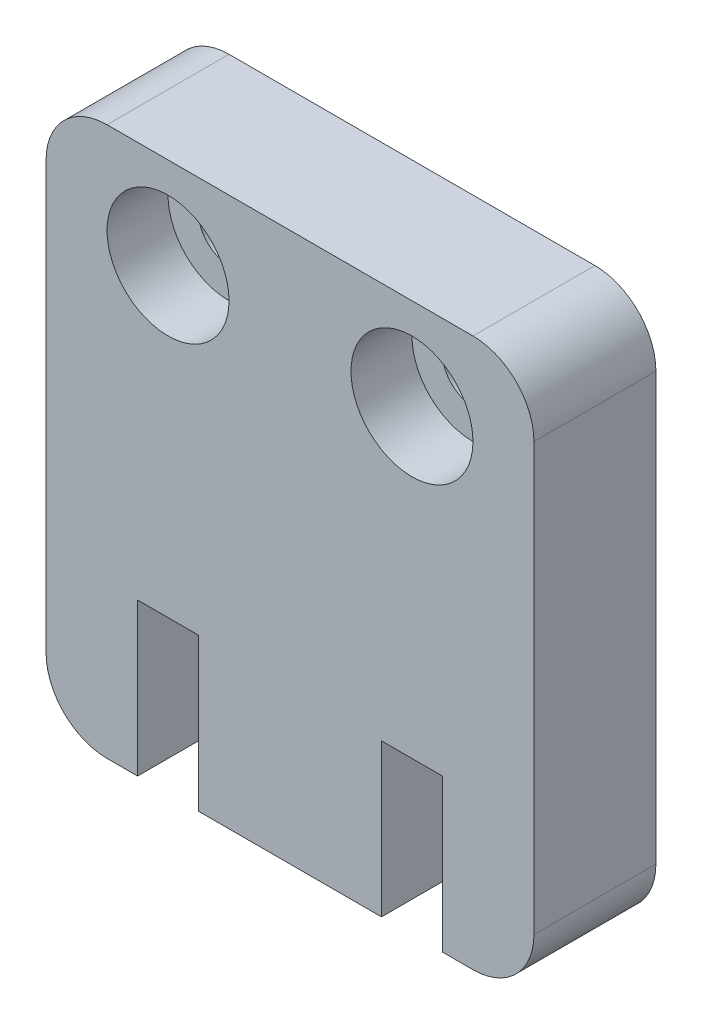
ISO-10303-21;
HEADER;
FILE_DESCRIPTION(('STEP AP214'),'2;1');
FILE_NAME('part.step','',(''),(''),'','','');
FILE_SCHEMA(('AUTOMOTIVE_DESIGN { 1 0 10303 214 1 1 1 1 }'));
ENDSEC;
DATA;
#1=APPLICATION_CONTEXT('core data for automotive mechanical design processes');
#2=APPLICATION_PROTOCOL_DEFINITION('international standard','automotive_design',2000,#1);
#3=PRODUCT_CONTEXT('',#1,'mechanical');
#4=PRODUCT('Part','Part','',(#3));
#5=PRODUCT_RELATED_PRODUCT_CATEGORY('part','',(#4));
#6=PRODUCT_DEFINITION_FORMATION('','',#4);
#7=PRODUCT_DEFINITION_CONTEXT('part definition',#1,'design');
#8=PRODUCT_DEFINITION('design','',#6,#7);
#9=PRODUCT_DEFINITION_SHAPE('','',#8);
#10=(LENGTH_UNIT() NAMED_UNIT(*) SI_UNIT(.MILLI.,.METRE.));
#11=(NAMED_UNIT(*) PLANE_ANGLE_UNIT() SI_UNIT($,.RADIAN.));
#12=(NAMED_UNIT(*) SI_UNIT($,.STERADIAN.) SOLID_ANGLE_UNIT());
#13=UNCERTAINTY_MEASURE_WITH_UNIT(LENGTH_MEASURE(1.E-05),#10,'distance_accuracy_value','');
#14=(GEOMETRIC_REPRESENTATION_CONTEXT(3) GLOBAL_UNCERTAINTY_ASSIGNED_CONTEXT((#13)) GLOBAL_UNIT_ASSIGNED_CONTEXT((#10,
#11,#12)) REPRESENTATION_CONTEXT('',''));
#15=CARTESIAN_POINT('',(0.,0.,0.));
#16=DIRECTION('',(0.,0.,1.));
#17=DIRECTION('',(1.,0.,0.));
#18=AXIS2_PLACEMENT_3D('',#15,#16,#17);
#19=CARTESIAN_POINT('',(12.,15.,4.));
#20=DIRECTION('',(0.,0.,-1.));
#21=DIRECTION('',(-1.,0.,0.));
#22=AXIS2_PLACEMENT_3D('',#19,#20,#21);
#23=CYLINDRICAL_SURFACE('',#22,1.);
#24=CARTESIAN_POINT('',(12.,15.,0.));
#25=DIRECTION('',(0.,0.,1.));
#26=DIRECTION('',(1.,0.,0.));
#27=AXIS2_PLACEMENT_3D('',#24,#25,#26);
#28=CIRCLE('',#27,1.);
#29=CARTESIAN_POINT('',(13.,15.,0.));
#30=VERTEX_POINT('',#29);
#31=EDGE_CURVE('E248',#30,#30,#28,.T.);
#32=ORIENTED_EDGE('',*,*,#31,.F.);
#33=EDGE_LOOP('',(#32));
#34=FACE_BOUND('',#33,.T.);
#35=CARTESIAN_POINT('',(12.,15.,2.));
#36=DIRECTION('',(0.,0.,1.));
#37=DIRECTION('',(1.,0.,0.));
#38=AXIS2_PLACEMENT_3D('',#35,#36,#37);
#39=CIRCLE('',#38,1.);
#40=CARTESIAN_POINT('',(13.,15.,2.));
#41=VERTEX_POINT('',#40);
#42=EDGE_CURVE('E37',#41,#41,#39,.T.);
#43=ORIENTED_EDGE('',*,*,#42,.T.);
#44=EDGE_LOOP('',(#43));
#45=FACE_BOUND('',#44,.T.);
#46=ADVANCED_FACE('F33',(#34,#45),#23,.F.);
#47=CARTESIAN_POINT('',(4.,15.,4.));
#48=DIRECTION('',(0.,0.,-1.));
#49=DIRECTION('',(-1.,0.,0.));
#50=AXIS2_PLACEMENT_3D('',#47,#48,#49);
#51=CYLINDRICAL_SURFACE('',#50,1.);
#52=CARTESIAN_POINT('',(4.,15.,0.));
#53=DIRECTION('',(0.,0.,1.));
#54=DIRECTION('',(1.,0.,0.));
#55=AXIS2_PLACEMENT_3D('',#52,#53,#54);
#56=CIRCLE('',#55,1.);
#57=CARTESIAN_POINT('',(5.,15.,0.));
#58=VERTEX_POINT('',#57);
#59=EDGE_CURVE('E184',#58,#58,#56,.T.);
#60=ORIENTED_EDGE('',*,*,#59,.F.);
#61=EDGE_LOOP('',(#60));
#62=FACE_BOUND('',#61,.T.);
#63=CARTESIAN_POINT('',(4.,15.,2.));
#64=DIRECTION('',(0.,0.,1.));
#65=DIRECTION('',(1.,0.,0.));
#66=AXIS2_PLACEMENT_3D('',#63,#64,#65);
#67=CIRCLE('',#66,1.);
#68=CARTESIAN_POINT('',(5.,15.,2.));
#69=VERTEX_POINT('',#68);
#70=EDGE_CURVE('E246',#69,#69,#67,.T.);
#71=ORIENTED_EDGE('',*,*,#70,.T.);
#72=EDGE_LOOP('',(#71));
#73=FACE_BOUND('',#72,.T.);
#74=ADVANCED_FACE('F320',(#62,#73),#51,.F.);
#75=CARTESIAN_POINT('',(14.,2.,4.));
#76=DIRECTION('',(0.,0.,-1.));
#77=DIRECTION('',(-1.,0.,0.));
#78=AXIS2_PLACEMENT_3D('',#75,#76,#77);
#79=PLANE('',#78);
#80=CARTESIAN_POINT('',(12.,15.,4.));
#81=DIRECTION('',(0.,0.,1.));
#82=DIRECTION('',(1.,0.,0.));
#83=AXIS2_PLACEMENT_3D('',#80,#81,#82);
#84=CIRCLE('',#83,2.);
#85=CARTESIAN_POINT('',(14.,15.,4.));
#86=VERTEX_POINT('',#85);
#87=EDGE_CURVE('E262',#86,#86,#84,.T.);
#88=ORIENTED_EDGE('',*,*,#87,.F.);
#89=EDGE_LOOP('',(#88));
#90=FACE_BOUND('',#89,.T.);
#91=CARTESIAN_POINT('',(4.,15.,4.));
#92=DIRECTION('',(0.,0.,1.));
#93=DIRECTION('',(1.,0.,0.));
#94=AXIS2_PLACEMENT_3D('',#91,#92,#93);
#95=CIRCLE('',#94,2.);
#96=CARTESIAN_POINT('',(6.,15.,4.));
#97=VERTEX_POINT('',#96);
#98=EDGE_CURVE('E255',#97,#97,#95,.T.);
#99=ORIENTED_EDGE('',*,*,#98,.F.);
#100=EDGE_LOOP('',(#99));
#101=FACE_BOUND('',#100,.T.);
#102=DIRECTION('',(0.,1.,0.));
#103=VECTOR('',#102,1.);
#104=CARTESIAN_POINT('',(3.,0.,4.));
#105=LINE('',#104,#103);
#106=CARTESIAN_POINT('',(3.,0.,4.));
#107=VERTEX_POINT('',#106);
#108=CARTESIAN_POINT('',(3.,5.,4.));
#109=VERTEX_POINT('',#108);
#110=EDGE_CURVE('E211',#107,#109,#105,.T.);
#111=ORIENTED_EDGE('',*,*,#110,.T.);
#112=DIRECTION('',(1.,0.,0.));
#113=VECTOR('',#112,1.);
#114=CARTESIAN_POINT('',(3.,5.,4.));
#115=LINE('',#114,#113);
#116=CARTESIAN_POINT('',(5.,5.,4.));
#117=VERTEX_POINT('',#116);
#118=EDGE_CURVE('E119',#109,#117,#115,.T.);
#119=ORIENTED_EDGE('',*,*,#118,.T.);
#120=DIRECTION('',(0.,-1.,0.));
#121=VECTOR('',#120,1.);
#122=CARTESIAN_POINT('',(5.,5.,4.));
#123=LINE('',#122,#121);
#124=CARTESIAN_POINT('',(5.,0.,4.));
#125=VERTEX_POINT('',#124);
#126=EDGE_CURVE('E269',#117,#125,#123,.T.);
#127=ORIENTED_EDGE('',*,*,#126,.T.);
#128=DIRECTION('',(1.,0.,0.));
#129=VECTOR('',#128,1.);
#130=CARTESIAN_POINT('',(5.,0.,4.));
#131=LINE('',#130,#129);
#132=CARTESIAN_POINT('',(11.,0.,4.));
#133=VERTEX_POINT('',#132);
#134=EDGE_CURVE('E271',#125,#133,#131,.T.);
#135=ORIENTED_EDGE('',*,*,#134,.T.);
#136=DIRECTION('',(0.,1.,0.));
#137=VECTOR('',#136,1.);
#138=CARTESIAN_POINT('',(11.,0.,4.));
#139=LINE('',#138,#137);
#140=CARTESIAN_POINT('',(11.,5.,4.));
#141=VERTEX_POINT('',#140);
#142=EDGE_CURVE('E273',#133,#141,#139,.T.);
#143=ORIENTED_EDGE('',*,*,#142,.T.);
#144=DIRECTION('',(1.,0.,0.));
#145=VECTOR('',#144,1.);
#146=CARTESIAN_POINT('',(11.,5.,4.));
#147=LINE('',#146,#145);
#148=CARTESIAN_POINT('',(13.,5.,4.));
#149=VERTEX_POINT('',#148);
#150=EDGE_CURVE('E275',#141,#149,#147,.T.);
#151=ORIENTED_EDGE('',*,*,#150,.T.);
#152=DIRECTION('',(0.,-1.,0.));
#153=VECTOR('',#152,1.);
#154=CARTESIAN_POINT('',(13.,5.,4.));
#155=LINE('',#154,#153);
#156=CARTESIAN_POINT('',(13.,0.,4.));
#157=VERTEX_POINT('',#156);
#158=EDGE_CURVE('E277',#149,#157,#155,.T.);
#159=ORIENTED_EDGE('',*,*,#158,.T.);
#160=DIRECTION('',(1.,0.,0.));
#161=VECTOR('',#160,1.);
#162=CARTESIAN_POINT('',(13.,0.,4.));
#163=LINE('',#162,#161);
#164=CARTESIAN_POINT('',(14.,0.,4.));
#165=VERTEX_POINT('',#164);
#166=EDGE_CURVE('E279',#157,#165,#163,.T.);
#167=ORIENTED_EDGE('',*,*,#166,.T.);
#168=CARTESIAN_POINT('',(14.,2.,4.));
#169=DIRECTION('',(0.,0.,1.));
#170=DIRECTION('',(-1.,0.,0.));
#171=AXIS2_PLACEMENT_3D('',#168,#169,#170);
#172=CIRCLE('',#171,2.);
#173=CARTESIAN_POINT('',(16.,2.,4.));
#174=VERTEX_POINT('',#173);
#175=EDGE_CURVE('E281',#165,#174,#172,.T.);
#176=ORIENTED_EDGE('',*,*,#175,.T.);
#177=DIRECTION('',(0.,1.,0.));
#178=VECTOR('',#177,1.);
#179=CARTESIAN_POINT('',(16.,16.,4.));
#180=LINE('',#179,#178);
#181=CARTESIAN_POINT('',(16.,16.,4.));
#182=VERTEX_POINT('',#181);
#183=EDGE_CURVE('E283',#174,#182,#180,.T.);
#184=ORIENTED_EDGE('',*,*,#183,.T.);
#185=CARTESIAN_POINT('',(14.,16.,4.));
#186=DIRECTION('',(0.,0.,1.));
#187=DIRECTION('',(-1.,0.,0.));
#188=AXIS2_PLACEMENT_3D('',#185,#186,#187);
#189=CIRCLE('',#188,2.);
#190=CARTESIAN_POINT('',(14.,18.,4.));
#191=VERTEX_POINT('',#190);
#192=EDGE_CURVE('E285',#182,#191,#189,.T.);
#193=ORIENTED_EDGE('',*,*,#192,.T.);
#194=DIRECTION('',(-1.,0.,0.));
#195=VECTOR('',#194,1.);
#196=CARTESIAN_POINT('',(2.,18.,4.));
#197=LINE('',#196,#195);
#198=CARTESIAN_POINT('',(2.,18.,4.));
#199=VERTEX_POINT('',#198);
#200=EDGE_CURVE('E287',#191,#199,#197,.T.);
#201=ORIENTED_EDGE('',*,*,#200,.T.);
#202=CARTESIAN_POINT('',(2.,16.,4.));
#203=DIRECTION('',(0.,0.,1.));
#204=DIRECTION('',(-1.,0.,0.));
#205=AXIS2_PLACEMENT_3D('',#202,#203,#204);
#206=CIRCLE('',#205,2.);
#207=CARTESIAN_POINT('',(0.,16.,4.));
#208=VERTEX_POINT('',#207);
#209=EDGE_CURVE('E162',#199,#208,#206,.T.);
#210=ORIENTED_EDGE('',*,*,#209,.T.);
#211=DIRECTION('',(0.,-1.,0.));
#212=VECTOR('',#211,1.);
#213=CARTESIAN_POINT('',(0.,2.00000000000001,4.));
#214=LINE('',#213,#212);
#215=CARTESIAN_POINT('',(0.,2.00000000000001,4.));
#216=VERTEX_POINT('',#215);
#217=EDGE_CURVE('E156',#208,#216,#214,.T.);
#218=ORIENTED_EDGE('',*,*,#217,.T.);
#219=CARTESIAN_POINT('',(2.,2.,4.));
#220=DIRECTION('',(0.,0.,1.));
#221=DIRECTION('',(-1.,0.,0.));
#222=AXIS2_PLACEMENT_3D('',#219,#220,#221);
#223=CIRCLE('',#222,2.);
#224=CARTESIAN_POINT('',(2.00000000000001,0.,4.));
#225=VERTEX_POINT('',#224);
#226=EDGE_CURVE('E160',#216,#225,#223,.T.);
#227=ORIENTED_EDGE('',*,*,#226,.T.);
#228=DIRECTION('',(1.,0.,0.));
#229=VECTOR('',#228,1.);
#230=CARTESIAN_POINT('',(2.00000000000001,0.,4.));
#231=LINE('',#230,#229);
#232=EDGE_CURVE('E52',#225,#107,#231,.T.);
#233=ORIENTED_EDGE('',*,*,#232,.T.);
#234=EDGE_LOOP('',(#111,#119,#127,#135,#143,#151,#159,#167,#176,#184,#193,#201,#210,#218,#227,#233));
#235=FACE_BOUND('',#234,.T.);
#236=ADVANCED_FACE('F158',(#90,#101,#235),#79,.F.);
#237=CARTESIAN_POINT('',(14.,2.,0.));
#238=DIRECTION('',(0.,0.,-1.));
#239=DIRECTION('',(-1.,0.,0.));
#240=AXIS2_PLACEMENT_3D('',#237,#238,#239);
#241=PLANE('',#240);
#242=ORIENTED_EDGE('',*,*,#59,.T.);
#243=EDGE_LOOP('',(#242));
#244=FACE_BOUND('',#243,.T.);
#245=DIRECTION('',(0.,1.,0.));
#246=VECTOR('',#245,1.);
#247=CARTESIAN_POINT('',(3.,0.,0.));
#248=LINE('',#247,#246);
#249=CARTESIAN_POINT('',(3.,0.,0.));
#250=VERTEX_POINT('',#249);
#251=CARTESIAN_POINT('',(3.,5.,0.));
#252=VERTEX_POINT('',#251);
#253=EDGE_CURVE('E180',#250,#252,#248,.T.);
#254=ORIENTED_EDGE('',*,*,#253,.F.);
#255=DIRECTION('',(1.,0.,0.));
#256=VECTOR('',#255,1.);
#257=CARTESIAN_POINT('',(2.00000000000001,0.,0.));
#258=LINE('',#257,#256);
#259=CARTESIAN_POINT('',(2.00000000000001,0.,0.));
#260=VERTEX_POINT('',#259);
#261=EDGE_CURVE('E111',#260,#250,#258,.T.);
#262=ORIENTED_EDGE('',*,*,#261,.F.);
#263=CARTESIAN_POINT('',(2.,2.,0.));
#264=DIRECTION('',(0.,0.,1.));
#265=DIRECTION('',(-1.,0.,0.));
#266=AXIS2_PLACEMENT_3D('',#263,#264,#265);
#267=CIRCLE('',#266,2.);
#268=CARTESIAN_POINT('',(0.,2.00000000000001,0.));
#269=VERTEX_POINT('',#268);
#270=EDGE_CURVE('E105',#269,#260,#267,.T.);
#271=ORIENTED_EDGE('',*,*,#270,.F.);
#272=DIRECTION('',(0.,-1.,0.));
#273=VECTOR('',#272,1.);
#274=CARTESIAN_POINT('',(0.,2.00000000000001,0.));
#275=LINE('',#274,#273);
#276=CARTESIAN_POINT('',(0.,16.,0.));
#277=VERTEX_POINT('',#276);
#278=EDGE_CURVE('E170',#277,#269,#275,.T.);
#279=ORIENTED_EDGE('',*,*,#278,.F.);
#280=CARTESIAN_POINT('',(2.,16.,0.));
#281=DIRECTION('',(0.,0.,1.));
#282=DIRECTION('',(-1.,0.,0.));
#283=AXIS2_PLACEMENT_3D('',#280,#281,#282);
#284=CIRCLE('',#283,2.);
#285=CARTESIAN_POINT('',(2.,18.,0.));
#286=VERTEX_POINT('',#285);
#287=EDGE_CURVE('E206',#286,#277,#284,.T.);
#288=ORIENTED_EDGE('',*,*,#287,.F.);
#289=DIRECTION('',(-1.,0.,0.));
#290=VECTOR('',#289,1.);
#291=CARTESIAN_POINT('',(2.,18.,0.));
#292=LINE('',#291,#290);
#293=CARTESIAN_POINT('',(14.,18.,0.));
#294=VERTEX_POINT('',#293);
#295=EDGE_CURVE('E204',#294,#286,#292,.T.);
#296=ORIENTED_EDGE('',*,*,#295,.F.);
#297=CARTESIAN_POINT('',(14.,16.,0.));
#298=DIRECTION('',(0.,0.,1.));
#299=DIRECTION('',(-1.,0.,0.));
#300=AXIS2_PLACEMENT_3D('',#297,#298,#299);
#301=CIRCLE('',#300,2.);
#302=CARTESIAN_POINT('',(16.,16.,0.));
#303=VERTEX_POINT('',#302);
#304=EDGE_CURVE('E202',#303,#294,#301,.T.);
#305=ORIENTED_EDGE('',*,*,#304,.F.);
#306=DIRECTION('',(0.,1.,0.));
#307=VECTOR('',#306,1.);
#308=CARTESIAN_POINT('',(16.,16.,0.));
#309=LINE('',#308,#307);
#310=CARTESIAN_POINT('',(16.,2.,0.));
#311=VERTEX_POINT('',#310);
#312=EDGE_CURVE('E200',#311,#303,#309,.T.);
#313=ORIENTED_EDGE('',*,*,#312,.F.);
#314=CARTESIAN_POINT('',(14.,2.,0.));
#315=DIRECTION('',(0.,0.,1.));
#316=DIRECTION('',(-1.,0.,0.));
#317=AXIS2_PLACEMENT_3D('',#314,#315,#316);
#318=CIRCLE('',#317,2.);
#319=CARTESIAN_POINT('',(14.,0.,0.));
#320=VERTEX_POINT('',#319);
#321=EDGE_CURVE('E198',#320,#311,#318,.T.);
#322=ORIENTED_EDGE('',*,*,#321,.F.);
#323=DIRECTION('',(1.,0.,0.));
#324=VECTOR('',#323,1.);
#325=CARTESIAN_POINT('',(13.,0.,0.));
#326=LINE('',#325,#324);
#327=CARTESIAN_POINT('',(13.,0.,0.));
#328=VERTEX_POINT('',#327);
#329=EDGE_CURVE('E196',#328,#320,#326,.T.);
#330=ORIENTED_EDGE('',*,*,#329,.F.);
#331=DIRECTION('',(0.,-1.,0.));
#332=VECTOR('',#331,1.);
#333=CARTESIAN_POINT('',(13.,5.,0.));
#334=LINE('',#333,#332);
#335=CARTESIAN_POINT('',(13.,5.,0.));
#336=VERTEX_POINT('',#335);
#337=EDGE_CURVE('E194',#336,#328,#334,.T.);
#338=ORIENTED_EDGE('',*,*,#337,.F.);
#339=DIRECTION('',(1.,0.,0.));
#340=VECTOR('',#339,1.);
#341=CARTESIAN_POINT('',(11.,5.,0.));
#342=LINE('',#341,#340);
#343=CARTESIAN_POINT('',(11.,5.,0.));
#344=VERTEX_POINT('',#343);
#345=EDGE_CURVE('E192',#344,#336,#342,.T.);
#346=ORIENTED_EDGE('',*,*,#345,.F.);
#347=DIRECTION('',(0.,1.,0.));
#348=VECTOR('',#347,1.);
#349=CARTESIAN_POINT('',(11.,0.,0.));
#350=LINE('',#349,#348);
#351=CARTESIAN_POINT('',(11.,0.,0.));
#352=VERTEX_POINT('',#351);
#353=EDGE_CURVE('E190',#352,#344,#350,.T.);
#354=ORIENTED_EDGE('',*,*,#353,.F.);
#355=DIRECTION('',(1.,0.,0.));
#356=VECTOR('',#355,1.);
#357=CARTESIAN_POINT('',(5.,0.,0.));
#358=LINE('',#357,#356);
#359=CARTESIAN_POINT('',(5.,0.,0.));
#360=VERTEX_POINT('',#359);
#361=EDGE_CURVE('E188',#360,#352,#358,.T.);
#362=ORIENTED_EDGE('',*,*,#361,.F.);
#363=DIRECTION('',(0.,-1.,0.));
#364=VECTOR('',#363,1.);
#365=CARTESIAN_POINT('',(5.,5.,0.));
#366=LINE('',#365,#364);
#367=CARTESIAN_POINT('',(5.,5.,0.));
#368=VERTEX_POINT('',#367);
#369=EDGE_CURVE('E186',#368,#360,#366,.T.);
#370=ORIENTED_EDGE('',*,*,#369,.F.);
#371=DIRECTION('',(1.,0.,0.));
#372=VECTOR('',#371,1.);
#373=CARTESIAN_POINT('',(3.,5.,0.));
#374=LINE('',#373,#372);
#375=EDGE_CURVE('E183',#252,#368,#374,.T.);
#376=ORIENTED_EDGE('',*,*,#375,.F.);
#377=EDGE_LOOP('',(#254,#262,#271,#279,#288,#296,#305,#313,#322,#330,#338,#346,#354,#362,#370,#376));
#378=FACE_BOUND('',#377,.T.);
#379=ORIENTED_EDGE('',*,*,#31,.T.);
#380=EDGE_LOOP('',(#379));
#381=FACE_BOUND('',#380,.T.);
#382=ADVANCED_FACE('F300',(#244,#378,#381),#241,.T.);
#383=CARTESIAN_POINT('',(3.,0.,4.));
#384=DIRECTION('',(-1.,0.,0.));
#385=DIRECTION('',(0.,0.,1.));
#386=AXIS2_PLACEMENT_3D('',#383,#384,#385);
#387=PLANE('',#386);
#388=ORIENTED_EDGE('',*,*,#253,.T.);
#389=DIRECTION('',(0.,0.,-1.));
#390=VECTOR('',#389,1.);
#391=CARTESIAN_POINT('',(3.,5.,4.));
#392=LINE('',#391,#390);
#393=EDGE_CURVE('E11',#109,#252,#392,.T.);
#394=ORIENTED_EDGE('',*,*,#393,.F.);
#395=ORIENTED_EDGE('',*,*,#110,.F.);
#396=DIRECTION('',(0.,0.,-1.));
#397=VECTOR('',#396,1.);
#398=CARTESIAN_POINT('',(3.,0.,4.));
#399=LINE('',#398,#397);
#400=EDGE_CURVE('E176',#107,#250,#399,.T.);
#401=ORIENTED_EDGE('',*,*,#400,.T.);
#402=EDGE_LOOP('',(#388,#394,#395,#401));
#403=FACE_BOUND('',#402,.T.);
#404=ADVANCED_FACE('F35',(#403),#387,.F.);
#405=CARTESIAN_POINT('',(3.,5.,4.));
#406=DIRECTION('',(0.,1.,0.));
#407=DIRECTION('',(0.,0.,1.));
#408=AXIS2_PLACEMENT_3D('',#405,#406,#407);
#409=PLANE('',#408);
#410=ORIENTED_EDGE('',*,*,#375,.T.);
#411=DIRECTION('',(0.,0.,-1.));
#412=VECTOR('',#411,1.);
#413=CARTESIAN_POINT('',(5.,5.,4.));
#414=LINE('',#413,#412);
#415=EDGE_CURVE('E43',#117,#368,#414,.T.);
#416=ORIENTED_EDGE('',*,*,#415,.F.);
#417=ORIENTED_EDGE('',*,*,#118,.F.);
#418=ORIENTED_EDGE('',*,*,#393,.T.);
#419=EDGE_LOOP('',(#410,#416,#417,#418));
#420=FACE_BOUND('',#419,.T.);
#421=ADVANCED_FACE('F339',(#420),#409,.F.);
#422=CARTESIAN_POINT('',(5.,5.,4.));
#423=DIRECTION('',(1.,0.,0.));
#424=DIRECTION('',(0.,0.,-1.));
#425=AXIS2_PLACEMENT_3D('',#422,#423,#424);
#426=PLANE('',#425);
#427=ORIENTED_EDGE('',*,*,#369,.T.);
#428=DIRECTION('',(0.,0.,-1.));
#429=VECTOR('',#428,1.);
#430=CARTESIAN_POINT('',(5.,0.,4.));
#431=LINE('',#430,#429);
#432=EDGE_CURVE('E242',#125,#360,#431,.T.);
#433=ORIENTED_EDGE('',*,*,#432,.F.);
#434=ORIENTED_EDGE('',*,*,#126,.F.);
#435=ORIENTED_EDGE('',*,*,#415,.T.);
#436=EDGE_LOOP('',(#427,#433,#434,#435));
#437=FACE_BOUND('',#436,.T.);
#438=ADVANCED_FACE('F344',(#437),#426,.F.);
#439=CARTESIAN_POINT('',(5.,0.,4.));
#440=DIRECTION('',(0.,1.,0.));
#441=DIRECTION('',(0.,0.,1.));
#442=AXIS2_PLACEMENT_3D('',#439,#440,#441);
#443=PLANE('',#442);
#444=ORIENTED_EDGE('',*,*,#361,.T.);
#445=DIRECTION('',(0.,0.,-1.));
#446=VECTOR('',#445,1.);
#447=CARTESIAN_POINT('',(11.,0.,4.));
#448=LINE('',#447,#446);
#449=EDGE_CURVE('E239',#133,#352,#448,.T.);
#450=ORIENTED_EDGE('',*,*,#449,.F.);
#451=ORIENTED_EDGE('',*,*,#134,.F.);
#452=ORIENTED_EDGE('',*,*,#432,.T.);
#453=EDGE_LOOP('',(#444,#450,#451,#452));
#454=FACE_BOUND('',#453,.T.);
#455=ADVANCED_FACE('F348',(#454),#443,.F.);
#456=CARTESIAN_POINT('',(11.,0.,4.));
#457=DIRECTION('',(-1.,0.,0.));
#458=DIRECTION('',(0.,0.,1.));
#459=AXIS2_PLACEMENT_3D('',#456,#457,#458);
#460=PLANE('',#459);
#461=ORIENTED_EDGE('',*,*,#353,.T.);
#462=DIRECTION('',(0.,0.,-1.));
#463=VECTOR('',#462,1.);
#464=CARTESIAN_POINT('',(11.,5.,4.));
#465=LINE('',#464,#463);
#466=EDGE_CURVE('E236',#141,#344,#465,.T.);
#467=ORIENTED_EDGE('',*,*,#466,.F.);
#468=ORIENTED_EDGE('',*,*,#142,.F.);
#469=ORIENTED_EDGE('',*,*,#449,.T.);
#470=EDGE_LOOP('',(#461,#467,#468,#469));
#471=FACE_BOUND('',#470,.T.);
#472=ADVANCED_FACE('F354',(#471),#460,.F.);
#473=CARTESIAN_POINT('',(11.,5.,4.));
#474=DIRECTION('',(0.,1.,0.));
#475=DIRECTION('',(0.,0.,1.));
#476=AXIS2_PLACEMENT_3D('',#473,#474,#475);
#477=PLANE('',#476);
#478=ORIENTED_EDGE('',*,*,#345,.T.);
#479=DIRECTION('',(0.,0.,-1.));
#480=VECTOR('',#479,1.);
#481=CARTESIAN_POINT('',(13.,5.,4.));
#482=LINE('',#481,#480);
#483=EDGE_CURVE('E233',#149,#336,#482,.T.);
#484=ORIENTED_EDGE('',*,*,#483,.F.);
#485=ORIENTED_EDGE('',*,*,#150,.F.);
#486=ORIENTED_EDGE('',*,*,#466,.T.);
#487=EDGE_LOOP('',(#478,#484,#485,#486));
#488=FACE_BOUND('',#487,.T.);
#489=ADVANCED_FACE('F358',(#488),#477,.F.);
#490=CARTESIAN_POINT('',(13.,5.,4.));
#491=DIRECTION('',(1.,0.,0.));
#492=DIRECTION('',(0.,0.,-1.));
#493=AXIS2_PLACEMENT_3D('',#490,#491,#492);
#494=PLANE('',#493);
#495=ORIENTED_EDGE('',*,*,#337,.T.);
#496=DIRECTION('',(0.,0.,-1.));
#497=VECTOR('',#496,1.);
#498=CARTESIAN_POINT('',(13.,0.,4.));
#499=LINE('',#498,#497);
#500=EDGE_CURVE('E230',#157,#328,#499,.T.);
#501=ORIENTED_EDGE('',*,*,#500,.F.);
#502=ORIENTED_EDGE('',*,*,#158,.F.);
#503=ORIENTED_EDGE('',*,*,#483,.T.);
#504=EDGE_LOOP('',(#495,#501,#502,#503));
#505=FACE_BOUND('',#504,.T.);
#506=ADVANCED_FACE('F362',(#505),#494,.F.);
#507=CARTESIAN_POINT('',(13.,0.,4.));
#508=DIRECTION('',(0.,1.,0.));
#509=DIRECTION('',(-1.,0.,0.));
#510=AXIS2_PLACEMENT_3D('',#507,#508,#509);
#511=PLANE('',#510);
#512=ORIENTED_EDGE('',*,*,#329,.T.);
#513=DIRECTION('',(0.,0.,-1.));
#514=VECTOR('',#513,1.);
#515=CARTESIAN_POINT('',(14.,0.,4.));
#516=LINE('',#515,#514);
#517=EDGE_CURVE('E227',#165,#320,#516,.T.);
#518=ORIENTED_EDGE('',*,*,#517,.F.);
#519=ORIENTED_EDGE('',*,*,#166,.F.);
#520=ORIENTED_EDGE('',*,*,#500,.T.);
#521=EDGE_LOOP('',(#512,#518,#519,#520));
#522=FACE_BOUND('',#521,.T.);
#523=ADVANCED_FACE('F366',(#522),#511,.F.);
#524=CARTESIAN_POINT('',(14.,2.,4.));
#525=DIRECTION('',(0.,0.,-1.));
#526=DIRECTION('',(-1.,0.,0.));
#527=AXIS2_PLACEMENT_3D('',#524,#525,#526);
#528=CYLINDRICAL_SURFACE('',#527,2.);
#529=ORIENTED_EDGE('',*,*,#321,.T.);
#530=DIRECTION('',(0.,0.,-1.));
#531=VECTOR('',#530,1.);
#532=CARTESIAN_POINT('',(16.,2.,4.));
#533=LINE('',#532,#531);
#534=EDGE_CURVE('E224',#174,#311,#533,.T.);
#535=ORIENTED_EDGE('',*,*,#534,.F.);
#536=ORIENTED_EDGE('',*,*,#175,.F.);
#537=ORIENTED_EDGE('',*,*,#517,.T.);
#538=EDGE_LOOP('',(#529,#535,#536,#537));
#539=FACE_BOUND('',#538,.T.);
#540=ADVANCED_FACE('F370',(#539),#528,.T.);
#541=CARTESIAN_POINT('',(16.,16.,4.));
#542=DIRECTION('',(-1.,0.,0.));
#543=DIRECTION('',(0.,0.,1.));
#544=AXIS2_PLACEMENT_3D('',#541,#542,#543);
#545=PLANE('',#544);
#546=ORIENTED_EDGE('',*,*,#312,.T.);
#547=DIRECTION('',(0.,0.,-1.));
#548=VECTOR('',#547,1.);
#549=CARTESIAN_POINT('',(16.,16.,4.));
#550=LINE('',#549,#548);
#551=EDGE_CURVE('E221',#182,#303,#550,.T.);
#552=ORIENTED_EDGE('',*,*,#551,.F.);
#553=ORIENTED_EDGE('',*,*,#183,.F.);
#554=ORIENTED_EDGE('',*,*,#534,.T.);
#555=EDGE_LOOP('',(#546,#552,#553,#554));
#556=FACE_BOUND('',#555,.T.);
#557=ADVANCED_FACE('F374',(#556),#545,.F.);
#558=CARTESIAN_POINT('',(14.,16.,4.));
#559=DIRECTION('',(0.,0.,-1.));
#560=DIRECTION('',(-1.,0.,0.));
#561=AXIS2_PLACEMENT_3D('',#558,#559,#560);
#562=CYLINDRICAL_SURFACE('',#561,2.);
#563=ORIENTED_EDGE('',*,*,#304,.T.);
#564=DIRECTION('',(0.,0.,-1.));
#565=VECTOR('',#564,1.);
#566=CARTESIAN_POINT('',(14.,18.,4.));
#567=LINE('',#566,#565);
#568=EDGE_CURVE('E218',#191,#294,#567,.T.);
#569=ORIENTED_EDGE('',*,*,#568,.F.);
#570=ORIENTED_EDGE('',*,*,#192,.F.);
#571=ORIENTED_EDGE('',*,*,#551,.T.);
#572=EDGE_LOOP('',(#563,#569,#570,#571));
#573=FACE_BOUND('',#572,.T.);
#574=ADVANCED_FACE('F378',(#573),#562,.T.);
#575=CARTESIAN_POINT('',(2.,18.,4.));
#576=DIRECTION('',(0.,-1.,0.));
#577=DIRECTION('',(0.,0.,-1.));
#578=AXIS2_PLACEMENT_3D('',#575,#576,#577);
#579=PLANE('',#578);
#580=ORIENTED_EDGE('',*,*,#295,.T.);
#581=DIRECTION('',(0.,0.,-1.));
#582=VECTOR('',#581,1.);
#583=CARTESIAN_POINT('',(2.,18.,4.));
#584=LINE('',#583,#582);
#585=EDGE_CURVE('E215',#199,#286,#584,.T.);
#586=ORIENTED_EDGE('',*,*,#585,.F.);
#587=ORIENTED_EDGE('',*,*,#200,.F.);
#588=ORIENTED_EDGE('',*,*,#568,.T.);
#589=EDGE_LOOP('',(#580,#586,#587,#588));
#590=FACE_BOUND('',#589,.T.);
#591=ADVANCED_FACE('F293',(#590),#579,.F.);
#592=CARTESIAN_POINT('',(2.,16.,4.));
#593=DIRECTION('',(0.,0.,-1.));
#594=DIRECTION('',(-1.,0.,0.));
#595=AXIS2_PLACEMENT_3D('',#592,#593,#594);
#596=CYLINDRICAL_SURFACE('',#595,2.);
#597=ORIENTED_EDGE('',*,*,#287,.T.);
#598=DIRECTION('',(0.,0.,-1.));
#599=VECTOR('',#598,1.);
#600=CARTESIAN_POINT('',(0.,16.,4.));
#601=LINE('',#600,#599);
#602=EDGE_CURVE('E171',#208,#277,#601,.T.);
#603=ORIENTED_EDGE('',*,*,#602,.F.);
#604=ORIENTED_EDGE('',*,*,#209,.F.);
#605=ORIENTED_EDGE('',*,*,#585,.T.);
#606=EDGE_LOOP('',(#597,#603,#604,#605));
#607=FACE_BOUND('',#606,.T.);
#608=ADVANCED_FACE('F297',(#607),#596,.T.);
#609=CARTESIAN_POINT('',(0.,2.00000000000001,4.));
#610=DIRECTION('',(1.,0.,0.));
#611=DIRECTION('',(0.,0.,-1.));
#612=AXIS2_PLACEMENT_3D('',#609,#610,#611);
#613=PLANE('',#612);
#614=ORIENTED_EDGE('',*,*,#278,.T.);
#615=DIRECTION('',(0.,0.,-1.));
#616=VECTOR('',#615,1.);
#617=CARTESIAN_POINT('',(0.,2.00000000000001,4.));
#618=LINE('',#617,#616);
#619=EDGE_CURVE('E167',#216,#269,#618,.T.);
#620=ORIENTED_EDGE('',*,*,#619,.F.);
#621=ORIENTED_EDGE('',*,*,#217,.F.);
#622=ORIENTED_EDGE('',*,*,#602,.T.);
#623=EDGE_LOOP('',(#614,#620,#621,#622));
#624=FACE_BOUND('',#623,.T.);
#625=ADVANCED_FACE('F168',(#624),#613,.F.);
#626=CARTESIAN_POINT('',(2.,2.,4.));
#627=DIRECTION('',(0.,0.,-1.));
#628=DIRECTION('',(-1.,0.,0.));
#629=AXIS2_PLACEMENT_3D('',#626,#627,#628);
#630=CYLINDRICAL_SURFACE('',#629,2.);
#631=ORIENTED_EDGE('',*,*,#270,.T.);
#632=DIRECTION('',(0.,0.,-1.));
#633=VECTOR('',#632,1.);
#634=CARTESIAN_POINT('',(2.00000000000001,0.,4.));
#635=LINE('',#634,#633);
#636=EDGE_CURVE('E172',#225,#260,#635,.T.);
#637=ORIENTED_EDGE('',*,*,#636,.F.);
#638=ORIENTED_EDGE('',*,*,#226,.F.);
#639=ORIENTED_EDGE('',*,*,#619,.T.);
#640=EDGE_LOOP('',(#631,#637,#638,#639));
#641=FACE_BOUND('',#640,.T.);
#642=ADVANCED_FACE('F174',(#641),#630,.T.);
#643=CARTESIAN_POINT('',(2.00000000000001,0.,4.));
#644=DIRECTION('',(0.,1.,0.));
#645=DIRECTION('',(0.,0.,1.));
#646=AXIS2_PLACEMENT_3D('',#643,#644,#645);
#647=PLANE('',#646);
#648=ORIENTED_EDGE('',*,*,#261,.T.);
#649=ORIENTED_EDGE('',*,*,#400,.F.);
#650=ORIENTED_EDGE('',*,*,#232,.F.);
#651=ORIENTED_EDGE('',*,*,#636,.T.);
#652=EDGE_LOOP('',(#648,#649,#650,#651));
#653=FACE_BOUND('',#652,.T.);
#654=ADVANCED_FACE('F306',(#653),#647,.F.);
#655=CARTESIAN_POINT('',(4.,15.,2.));
#656=DIRECTION('',(0.,0.,1.));
#657=DIRECTION('',(1.,0.,0.));
#658=AXIS2_PLACEMENT_3D('',#655,#656,#657);
#659=CYLINDRICAL_SURFACE('',#658,2.);
#660=CARTESIAN_POINT('',(4.,15.,2.));
#661=DIRECTION('',(0.,0.,1.));
#662=DIRECTION('',(1.,0.,0.));
#663=AXIS2_PLACEMENT_3D('',#660,#661,#662);
#664=CIRCLE('',#663,2.);
#665=CARTESIAN_POINT('',(6.,15.,2.));
#666=VERTEX_POINT('',#665);
#667=EDGE_CURVE('E249',#666,#666,#664,.T.);
#668=ORIENTED_EDGE('',*,*,#667,.F.);
#669=EDGE_LOOP('',(#668));
#670=FACE_BOUND('',#669,.T.);
#671=ORIENTED_EDGE('',*,*,#98,.T.);
#672=EDGE_LOOP('',(#671));
#673=FACE_BOUND('',#672,.T.);
#674=ADVANCED_FACE('F308',(#670,#673),#659,.F.);
#675=CARTESIAN_POINT('',(4.,15.,2.));
#676=DIRECTION('',(0.,0.,1.));
#677=DIRECTION('',(1.,0.,0.));
#678=AXIS2_PLACEMENT_3D('',#675,#676,#677);
#679=PLANE('',#678);
#680=ORIENTED_EDGE('',*,*,#70,.F.);
#681=EDGE_LOOP('',(#680));
#682=FACE_BOUND('',#681,.T.);
#683=ORIENTED_EDGE('',*,*,#667,.T.);
#684=EDGE_LOOP('',(#683));
#685=FACE_BOUND('',#684,.T.);
#686=ADVANCED_FACE('F314',(#682,#685),#679,.T.);
#687=CARTESIAN_POINT('',(12.,15.,2.));
#688=DIRECTION('',(0.,0.,1.));
#689=DIRECTION('',(1.,0.,0.));
#690=AXIS2_PLACEMENT_3D('',#687,#688,#689);
#691=CYLINDRICAL_SURFACE('',#690,2.);
#692=CARTESIAN_POINT('',(12.,15.,2.));
#693=DIRECTION('',(0.,0.,1.));
#694=DIRECTION('',(1.,0.,0.));
#695=AXIS2_PLACEMENT_3D('',#692,#693,#694);
#696=CIRCLE('',#695,2.);
#697=CARTESIAN_POINT('',(14.,15.,2.));
#698=VERTEX_POINT('',#697);
#699=EDGE_CURVE('E460',#698,#698,#696,.T.);
#700=ORIENTED_EDGE('',*,*,#699,.F.);
#701=EDGE_LOOP('',(#700));
#702=FACE_BOUND('',#701,.T.);
#703=ORIENTED_EDGE('',*,*,#87,.T.);
#704=EDGE_LOOP('',(#703));
#705=FACE_BOUND('',#704,.T.);
#706=ADVANCED_FACE('F432',(#702,#705),#691,.F.);
#707=CARTESIAN_POINT('',(12.,15.,2.));
#708=DIRECTION('',(0.,0.,1.));
#709=DIRECTION('',(1.,0.,0.));
#710=AXIS2_PLACEMENT_3D('',#707,#708,#709);
#711=PLANE('',#710);
#712=ORIENTED_EDGE('',*,*,#42,.F.);
#713=EDGE_LOOP('',(#712));
#714=FACE_BOUND('',#713,.T.);
#715=ORIENTED_EDGE('',*,*,#699,.T.);
#716=EDGE_LOOP('',(#715));
#717=FACE_BOUND('',#716,.T.);
#718=ADVANCED_FACE('F441',(#714,#717),#711,.T.);
#719=CLOSED_SHELL('',(#46,#74,#236,#382,#404,#421,#438,#455,#472,#489,#506,#523,#540,#557,#574,
#591,#608,#625,#642,#654,#674,#686,#706,#718));
#720=MANIFOLD_SOLID_BREP('B2',#719);
#721=ADVANCED_BREP_SHAPE_REPRESENTATION('',(#18,#720),#14);
#722=SHAPE_DEFINITION_REPRESENTATION(#9,#721);
ENDSEC;
END-ISO-10303-21;
